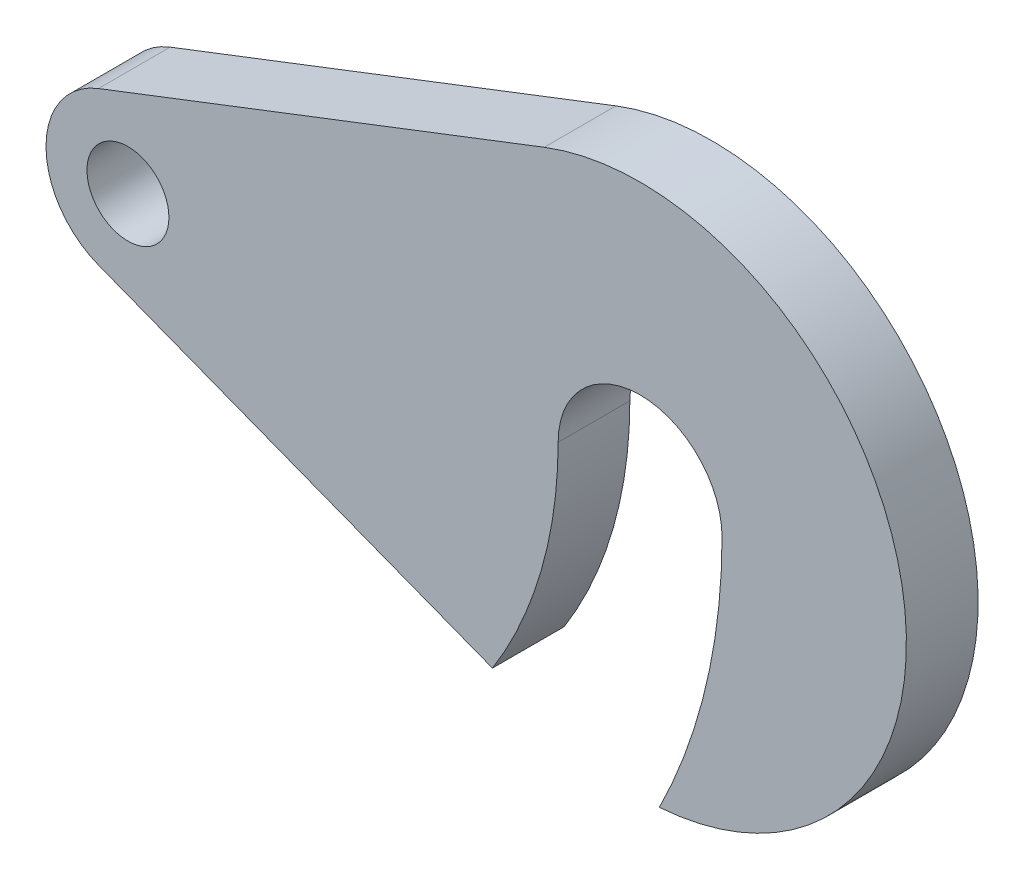
ISO-10303-21;
HEADER;
FILE_DESCRIPTION(('STEP AP214'),'2;1');
FILE_NAME('part.step','',(''),(''),'','','');
FILE_SCHEMA(('AUTOMOTIVE_DESIGN { 1 0 10303 214 1 1 1 1 }'));
ENDSEC;
DATA;
#1=APPLICATION_CONTEXT('core data for automotive mechanical design processes');
#2=APPLICATION_PROTOCOL_DEFINITION('international standard','automotive_design',2000,#1);
#3=PRODUCT_CONTEXT('',#1,'mechanical');
#4=PRODUCT('Part','Part','',(#3));
#5=PRODUCT_RELATED_PRODUCT_CATEGORY('part','',(#4));
#6=PRODUCT_DEFINITION_FORMATION('','',#4);
#7=PRODUCT_DEFINITION_CONTEXT('part definition',#1,'design');
#8=PRODUCT_DEFINITION('design','',#6,#7);
#9=PRODUCT_DEFINITION_SHAPE('','',#8);
#10=(LENGTH_UNIT() NAMED_UNIT(*) SI_UNIT(.MILLI.,.METRE.));
#11=(NAMED_UNIT(*) PLANE_ANGLE_UNIT() SI_UNIT($,.RADIAN.));
#12=(NAMED_UNIT(*) SI_UNIT($,.STERADIAN.) SOLID_ANGLE_UNIT());
#13=UNCERTAINTY_MEASURE_WITH_UNIT(LENGTH_MEASURE(1.E-05),#10,'distance_accuracy_value','');
#14=(GEOMETRIC_REPRESENTATION_CONTEXT(3) GLOBAL_UNCERTAINTY_ASSIGNED_CONTEXT((#13)) GLOBAL_UNIT_ASSIGNED_CONTEXT((#10,
#11,#12)) REPRESENTATION_CONTEXT('',''));
#15=CARTESIAN_POINT('',(0.,0.,0.));
#16=DIRECTION('',(0.,0.,1.));
#17=DIRECTION('',(1.,0.,0.));
#18=AXIS2_PLACEMENT_3D('',#15,#16,#17);
#19=CARTESIAN_POINT('',(-50.,0.,7.));
#20=DIRECTION('',(0.,0.,-1.));
#21=DIRECTION('',(-1.,0.,0.));
#22=AXIS2_PLACEMENT_3D('',#19,#20,#21);
#23=PLANE('',#22);
#24=CARTESIAN_POINT('',(-50.,0.,7.));
#25=DIRECTION('',(0.,0.,1.));
#26=DIRECTION('',(-1.,0.,0.));
#27=AXIS2_PLACEMENT_3D('',#24,#25,#26);
#28=CIRCLE('',#27,42.);
#29=CARTESIAN_POINT('',(-14.4133911034518,-22.3067986776256,7.));
#30=VERTEX_POINT('',#29);
#31=CARTESIAN_POINT('',(-8.,0.,7.));
#32=VERTEX_POINT('',#31);
#33=EDGE_CURVE('E139',#30,#32,#28,.T.);
#34=ORIENTED_EDGE('',*,*,#33,.T.);
#35=CARTESIAN_POINT('',(0.,0.,7.));
#36=DIRECTION('',(0.,0.,-1.));
#37=DIRECTION('',(1.,0.,0.));
#38=AXIS2_PLACEMENT_3D('',#35,#36,#37);
#39=CIRCLE('',#38,8.);
#40=CARTESIAN_POINT('',(8.,0.,7.));
#41=VERTEX_POINT('',#40);
#42=EDGE_CURVE('E92',#32,#41,#39,.T.);
#43=ORIENTED_EDGE('',*,*,#42,.T.);
#44=CARTESIAN_POINT('',(-50.,0.,7.));
#45=DIRECTION('',(0.,0.,-1.));
#46=DIRECTION('',(-1.,0.,0.));
#47=AXIS2_PLACEMENT_3D('',#44,#45,#46);
#48=CIRCLE('',#47,58.);
#49=CARTESIAN_POINT('',(1.88000000000001,-25.9319416935948,7.));
#50=VERTEX_POINT('',#49);
#51=EDGE_CURVE('E151',#41,#50,#48,.T.);
#52=ORIENTED_EDGE('',*,*,#51,.T.);
#53=CARTESIAN_POINT('',(0.,0.,7.));
#54=DIRECTION('',(0.,0.,1.));
#55=DIRECTION('',(1.,0.,0.));
#56=AXIS2_PLACEMENT_3D('',#53,#54,#55);
#57=CIRCLE('',#56,26.);
#58=CARTESIAN_POINT('',(-9.36,24.2567598825565,7.));
#59=VERTEX_POINT('',#58);
#60=EDGE_CURVE('E108',#50,#59,#57,.T.);
#61=ORIENTED_EDGE('',*,*,#60,.T.);
#62=DIRECTION('',(-0.932952303175248,-0.36,0.));
#63=VECTOR('',#62,1.);
#64=CARTESIAN_POINT('',(-52.88,7.46361842540199,7.));
#65=LINE('',#64,#63);
#66=CARTESIAN_POINT('',(-52.88,7.46361842540199,7.));
#67=VERTEX_POINT('',#66);
#68=EDGE_CURVE('E102',#59,#67,#65,.T.);
#69=ORIENTED_EDGE('',*,*,#68,.T.);
#70=CARTESIAN_POINT('',(-50.,0.,7.));
#71=DIRECTION('',(0.,0.,1.));
#72=DIRECTION('',(1.,0.,0.));
#73=AXIS2_PLACEMENT_3D('',#70,#71,#72);
#74=CIRCLE('',#73,8.);
#75=CARTESIAN_POINT('',(-52.88,-7.46361842540199,7.));
#76=VERTEX_POINT('',#75);
#77=EDGE_CURVE('E106',#67,#76,#74,.T.);
#78=ORIENTED_EDGE('',*,*,#77,.T.);
#79=DIRECTION('',(0.932952303175248,-0.36,0.));
#80=VECTOR('',#79,1.);
#81=CARTESIAN_POINT('',(-52.88,-7.46361842540199,7.));
#82=LINE('',#81,#80);
#83=EDGE_CURVE('E52',#76,#30,#82,.T.);
#84=ORIENTED_EDGE('',*,*,#83,.T.);
#85=EDGE_LOOP('',(#34,#43,#52,#61,#69,#78,#84));
#86=FACE_BOUND('',#85,.T.);
#87=CARTESIAN_POINT('',(-50.,0.,7.));
#88=DIRECTION('',(0.,0.,1.));
#89=DIRECTION('',(1.,0.,0.));
#90=AXIS2_PLACEMENT_3D('',#87,#88,#89);
#91=CIRCLE('',#90,4.00000000000001);
#92=CARTESIAN_POINT('',(-46.,0.,7.));
#93=VERTEX_POINT('',#92);
#94=EDGE_CURVE('E130',#93,#93,#91,.T.);
#95=ORIENTED_EDGE('',*,*,#94,.F.);
#96=EDGE_LOOP('',(#95));
#97=FACE_BOUND('',#96,.T.);
#98=ADVANCED_FACE('F35',(#86,#97),#23,.F.);
#99=CARTESIAN_POINT('',(-50.,0.,0.));
#100=DIRECTION('',(0.,0.,-1.));
#101=DIRECTION('',(-1.,0.,0.));
#102=AXIS2_PLACEMENT_3D('',#99,#100,#101);
#103=PLANE('',#102);
#104=CARTESIAN_POINT('',(-50.,0.,0.));
#105=DIRECTION('',(0.,0.,1.));
#106=DIRECTION('',(-1.,0.,0.));
#107=AXIS2_PLACEMENT_3D('',#104,#105,#106);
#108=CIRCLE('',#107,42.);
#109=CARTESIAN_POINT('',(-14.4133911034518,-22.3067986776256,0.));
#110=VERTEX_POINT('',#109);
#111=CARTESIAN_POINT('',(-8.,0.,0.));
#112=VERTEX_POINT('',#111);
#113=EDGE_CURVE('E126',#110,#112,#108,.T.);
#114=ORIENTED_EDGE('',*,*,#113,.F.);
#115=DIRECTION('',(0.932952303175248,-0.36,0.));
#116=VECTOR('',#115,1.);
#117=CARTESIAN_POINT('',(-52.88,-7.46361842540199,0.));
#118=LINE('',#117,#116);
#119=CARTESIAN_POINT('',(-52.88,-7.46361842540199,0.));
#120=VERTEX_POINT('',#119);
#121=EDGE_CURVE('E84',#120,#110,#118,.T.);
#122=ORIENTED_EDGE('',*,*,#121,.F.);
#123=CARTESIAN_POINT('',(-50.,0.,0.));
#124=DIRECTION('',(0.,0.,1.));
#125=DIRECTION('',(1.,0.,0.));
#126=AXIS2_PLACEMENT_3D('',#123,#124,#125);
#127=CIRCLE('',#126,8.);
#128=CARTESIAN_POINT('',(-52.88,7.46361842540199,0.));
#129=VERTEX_POINT('',#128);
#130=EDGE_CURVE('E78',#129,#120,#127,.T.);
#131=ORIENTED_EDGE('',*,*,#130,.F.);
#132=DIRECTION('',(-0.932952303175248,-0.36,0.));
#133=VECTOR('',#132,1.);
#134=CARTESIAN_POINT('',(-52.88,7.46361842540199,0.));
#135=LINE('',#134,#133);
#136=CARTESIAN_POINT('',(-9.36,24.2567598825565,0.));
#137=VERTEX_POINT('',#136);
#138=EDGE_CURVE('E116',#137,#129,#135,.T.);
#139=ORIENTED_EDGE('',*,*,#138,.F.);
#140=CARTESIAN_POINT('',(0.,0.,0.));
#141=DIRECTION('',(0.,0.,1.));
#142=DIRECTION('',(1.,0.,0.));
#143=AXIS2_PLACEMENT_3D('',#140,#141,#142);
#144=CIRCLE('',#143,26.);
#145=CARTESIAN_POINT('',(1.88000000000001,-25.9319416935948,0.));
#146=VERTEX_POINT('',#145);
#147=EDGE_CURVE('E134',#146,#137,#144,.T.);
#148=ORIENTED_EDGE('',*,*,#147,.F.);
#149=CARTESIAN_POINT('',(-50.,0.,0.));
#150=DIRECTION('',(0.,0.,-1.));
#151=DIRECTION('',(-1.,0.,0.));
#152=AXIS2_PLACEMENT_3D('',#149,#150,#151);
#153=CIRCLE('',#152,58.);
#154=CARTESIAN_POINT('',(8.,0.,0.));
#155=VERTEX_POINT('',#154);
#156=EDGE_CURVE('E132',#155,#146,#153,.T.);
#157=ORIENTED_EDGE('',*,*,#156,.F.);
#158=CARTESIAN_POINT('',(0.,0.,0.));
#159=DIRECTION('',(0.,0.,-1.));
#160=DIRECTION('',(1.,0.,0.));
#161=AXIS2_PLACEMENT_3D('',#158,#159,#160);
#162=CIRCLE('',#161,8.);
#163=EDGE_CURVE('E129',#112,#155,#162,.T.);
#164=ORIENTED_EDGE('',*,*,#163,.F.);
#165=EDGE_LOOP('',(#114,#122,#131,#139,#148,#157,#164));
#166=FACE_BOUND('',#165,.T.);
#167=CARTESIAN_POINT('',(-50.,0.,0.));
#168=DIRECTION('',(0.,0.,1.));
#169=DIRECTION('',(1.,0.,0.));
#170=AXIS2_PLACEMENT_3D('',#167,#168,#169);
#171=CIRCLE('',#170,4.00000000000001);
#172=CARTESIAN_POINT('',(-46.,0.,0.));
#173=VERTEX_POINT('',#172);
#174=EDGE_CURVE('E163',#173,#173,#171,.T.);
#175=ORIENTED_EDGE('',*,*,#174,.T.);
#176=EDGE_LOOP('',(#175));
#177=FACE_BOUND('',#176,.T.);
#178=ADVANCED_FACE('F155',(#166,#177),#103,.T.);
#179=CARTESIAN_POINT('',(-50.,0.,7.));
#180=DIRECTION('',(0.,0.,-1.));
#181=DIRECTION('',(-1.,0.,0.));
#182=AXIS2_PLACEMENT_3D('',#179,#180,#181);
#183=CYLINDRICAL_SURFACE('',#182,42.);
#184=ORIENTED_EDGE('',*,*,#113,.T.);
#185=DIRECTION('',(0.,0.,-1.));
#186=VECTOR('',#185,1.);
#187=CARTESIAN_POINT('',(-8.,0.,7.));
#188=LINE('',#187,#186);
#189=EDGE_CURVE('E11',#32,#112,#188,.T.);
#190=ORIENTED_EDGE('',*,*,#189,.F.);
#191=ORIENTED_EDGE('',*,*,#33,.F.);
#192=DIRECTION('',(0.,0.,-1.));
#193=VECTOR('',#192,1.);
#194=CARTESIAN_POINT('',(-14.4133911034518,-22.3067986776256,7.));
#195=LINE('',#194,#193);
#196=EDGE_CURVE('E122',#30,#110,#195,.T.);
#197=ORIENTED_EDGE('',*,*,#196,.T.);
#198=EDGE_LOOP('',(#184,#190,#191,#197));
#199=FACE_BOUND('',#198,.T.);
#200=ADVANCED_FACE('F37',(#199),#183,.T.);
#201=CARTESIAN_POINT('',(0.,0.,7.));
#202=DIRECTION('',(0.,0.,-1.));
#203=DIRECTION('',(-1.,0.,0.));
#204=AXIS2_PLACEMENT_3D('',#201,#202,#203);
#205=CYLINDRICAL_SURFACE('',#204,8.);
#206=ORIENTED_EDGE('',*,*,#163,.T.);
#207=DIRECTION('',(0.,0.,-1.));
#208=VECTOR('',#207,1.);
#209=CARTESIAN_POINT('',(8.,0.,7.));
#210=LINE('',#209,#208);
#211=EDGE_CURVE('E44',#41,#155,#210,.T.);
#212=ORIENTED_EDGE('',*,*,#211,.F.);
#213=ORIENTED_EDGE('',*,*,#42,.F.);
#214=ORIENTED_EDGE('',*,*,#189,.T.);
#215=EDGE_LOOP('',(#206,#212,#213,#214));
#216=FACE_BOUND('',#215,.T.);
#217=ADVANCED_FACE('F189',(#216),#205,.F.);
#218=CARTESIAN_POINT('',(-50.,0.,7.));
#219=DIRECTION('',(0.,0.,-1.));
#220=DIRECTION('',(-1.,0.,0.));
#221=AXIS2_PLACEMENT_3D('',#218,#219,#220);
#222=CYLINDRICAL_SURFACE('',#221,58.);
#223=ORIENTED_EDGE('',*,*,#156,.T.);
#224=DIRECTION('',(0.,0.,-1.));
#225=VECTOR('',#224,1.);
#226=CARTESIAN_POINT('',(1.88000000000001,-25.9319416935948,7.));
#227=LINE('',#226,#225);
#228=EDGE_CURVE('E143',#50,#146,#227,.T.);
#229=ORIENTED_EDGE('',*,*,#228,.F.);
#230=ORIENTED_EDGE('',*,*,#51,.F.);
#231=ORIENTED_EDGE('',*,*,#211,.T.);
#232=EDGE_LOOP('',(#223,#229,#230,#231));
#233=FACE_BOUND('',#232,.T.);
#234=ADVANCED_FACE('F149',(#233),#222,.F.);
#235=CARTESIAN_POINT('',(0.,0.,7.));
#236=DIRECTION('',(0.,0.,-1.));
#237=DIRECTION('',(-1.,0.,0.));
#238=AXIS2_PLACEMENT_3D('',#235,#236,#237);
#239=CYLINDRICAL_SURFACE('',#238,26.);
#240=ORIENTED_EDGE('',*,*,#147,.T.);
#241=DIRECTION('',(0.,0.,-1.));
#242=VECTOR('',#241,1.);
#243=CARTESIAN_POINT('',(-9.36,24.2567598825565,7.));
#244=LINE('',#243,#242);
#245=EDGE_CURVE('E117',#59,#137,#244,.T.);
#246=ORIENTED_EDGE('',*,*,#245,.F.);
#247=ORIENTED_EDGE('',*,*,#60,.F.);
#248=ORIENTED_EDGE('',*,*,#228,.T.);
#249=EDGE_LOOP('',(#240,#246,#247,#248));
#250=FACE_BOUND('',#249,.T.);
#251=ADVANCED_FACE('F158',(#250),#239,.T.);
#252=CARTESIAN_POINT('',(-52.88,7.46361842540199,7.));
#253=DIRECTION('',(0.36,-0.932952303175248,0.));
#254=DIRECTION('',(0.932952303175248,0.36,0.));
#255=AXIS2_PLACEMENT_3D('',#252,#253,#254);
#256=PLANE('',#255);
#257=ORIENTED_EDGE('',*,*,#138,.T.);
#258=DIRECTION('',(0.,0.,-1.));
#259=VECTOR('',#258,1.);
#260=CARTESIAN_POINT('',(-52.88,7.46361842540199,7.));
#261=LINE('',#260,#259);
#262=EDGE_CURVE('E113',#67,#129,#261,.T.);
#263=ORIENTED_EDGE('',*,*,#262,.F.);
#264=ORIENTED_EDGE('',*,*,#68,.F.);
#265=ORIENTED_EDGE('',*,*,#245,.T.);
#266=EDGE_LOOP('',(#257,#263,#264,#265));
#267=FACE_BOUND('',#266,.T.);
#268=ADVANCED_FACE('F114',(#267),#256,.F.);
#269=CARTESIAN_POINT('',(-50.,0.,7.));
#270=DIRECTION('',(0.,0.,-1.));
#271=DIRECTION('',(-1.,0.,0.));
#272=AXIS2_PLACEMENT_3D('',#269,#270,#271);
#273=CYLINDRICAL_SURFACE('',#272,8.);
#274=ORIENTED_EDGE('',*,*,#130,.T.);
#275=DIRECTION('',(0.,0.,-1.));
#276=VECTOR('',#275,1.);
#277=CARTESIAN_POINT('',(-52.88,-7.46361842540199,7.));
#278=LINE('',#277,#276);
#279=EDGE_CURVE('E118',#76,#120,#278,.T.);
#280=ORIENTED_EDGE('',*,*,#279,.F.);
#281=ORIENTED_EDGE('',*,*,#77,.F.);
#282=ORIENTED_EDGE('',*,*,#262,.T.);
#283=EDGE_LOOP('',(#274,#280,#281,#282));
#284=FACE_BOUND('',#283,.T.);
#285=ADVANCED_FACE('F120',(#284),#273,.T.);
#286=CARTESIAN_POINT('',(-52.88,-7.46361842540199,7.));
#287=DIRECTION('',(0.36,0.932952303175248,0.));
#288=DIRECTION('',(-0.932952303175248,0.36,0.));
#289=AXIS2_PLACEMENT_3D('',#286,#287,#288);
#290=PLANE('',#289);
#291=ORIENTED_EDGE('',*,*,#121,.T.);
#292=ORIENTED_EDGE('',*,*,#196,.F.);
#293=ORIENTED_EDGE('',*,*,#83,.F.);
#294=ORIENTED_EDGE('',*,*,#279,.T.);
#295=EDGE_LOOP('',(#291,#292,#293,#294));
#296=FACE_BOUND('',#295,.T.);
#297=ADVANCED_FACE('F179',(#296),#290,.F.);
#298=CARTESIAN_POINT('',(-50.,0.,7.));
#299=DIRECTION('',(0.,0.,-1.));
#300=DIRECTION('',(-1.,0.,0.));
#301=AXIS2_PLACEMENT_3D('',#298,#299,#300);
#302=CYLINDRICAL_SURFACE('',#301,4.00000000000001);
#303=ORIENTED_EDGE('',*,*,#94,.T.);
#304=EDGE_LOOP('',(#303));
#305=FACE_BOUND('',#304,.T.);
#306=ORIENTED_EDGE('',*,*,#174,.F.);
#307=EDGE_LOOP('',(#306));
#308=FACE_BOUND('',#307,.T.);
#309=ADVANCED_FACE('F169',(#305,#308),#302,.F.);
#310=CLOSED_SHELL('',(#98,#178,#200,#217,#234,#251,#268,#285,#297,#309));
#311=MANIFOLD_SOLID_BREP('B2',#310);
#312=ADVANCED_BREP_SHAPE_REPRESENTATION('',(#18,#311),#14);
#313=SHAPE_DEFINITION_REPRESENTATION(#9,#312);
ENDSEC;
END-ISO-10303-21;
